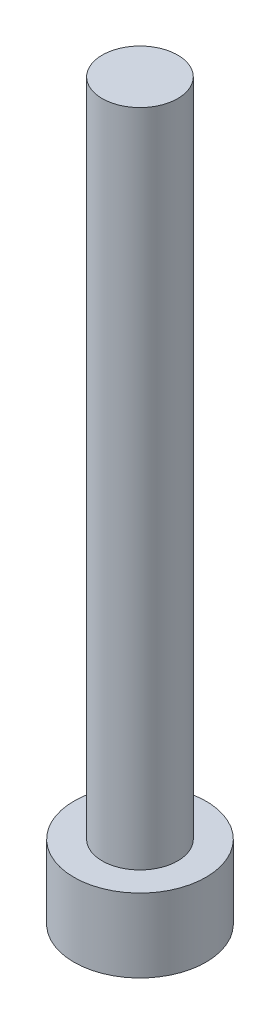
ISO-10303-21;
HEADER;
FILE_DESCRIPTION(('STEP AP214'),'2;1');
FILE_NAME('part.step','',(''),(''),'','','');
FILE_SCHEMA(('AUTOMOTIVE_DESIGN { 1 0 10303 214 1 1 1 1 }'));
ENDSEC;
DATA;
#1=APPLICATION_CONTEXT('core data for automotive mechanical design processes');
#2=APPLICATION_PROTOCOL_DEFINITION('international standard','automotive_design',2000,#1);
#3=PRODUCT_CONTEXT('',#1,'mechanical');
#4=PRODUCT('Part','Part','',(#3));
#5=PRODUCT_RELATED_PRODUCT_CATEGORY('part','',(#4));
#6=PRODUCT_DEFINITION_FORMATION('','',#4);
#7=PRODUCT_DEFINITION_CONTEXT('part definition',#1,'design');
#8=PRODUCT_DEFINITION('design','',#6,#7);
#9=PRODUCT_DEFINITION_SHAPE('','',#8);
#10=(LENGTH_UNIT() NAMED_UNIT(*) SI_UNIT(.MILLI.,.METRE.));
#11=(NAMED_UNIT(*) PLANE_ANGLE_UNIT() SI_UNIT($,.RADIAN.));
#12=(NAMED_UNIT(*) SI_UNIT($,.STERADIAN.) SOLID_ANGLE_UNIT());
#13=UNCERTAINTY_MEASURE_WITH_UNIT(LENGTH_MEASURE(1.E-05),#10,'distance_accuracy_value','');
#14=(GEOMETRIC_REPRESENTATION_CONTEXT(3) GLOBAL_UNCERTAINTY_ASSIGNED_CONTEXT((#13)) GLOBAL_UNIT_ASSIGNED_CONTEXT((#10,
#11,#12)) REPRESENTATION_CONTEXT('',''));
#15=CARTESIAN_POINT('',(0.,0.,0.));
#16=DIRECTION('',(0.,0.,1.));
#17=DIRECTION('',(1.,0.,0.));
#18=AXIS2_PLACEMENT_3D('',#15,#16,#17);
#19=CARTESIAN_POINT('',(0.,3.9,0.));
#20=DIRECTION('',(0.,-1.,0.));
#21=DIRECTION('',(0.,0.,-1.));
#22=AXIS2_PLACEMENT_3D('',#19,#20,#21);
#23=CYLINDRICAL_SURFACE('',#22,3.5);
#24=CARTESIAN_POINT('',(0.,3.9,0.));
#25=DIRECTION('',(0.,1.,0.));
#26=DIRECTION('',(0.,0.,1.));
#27=AXIS2_PLACEMENT_3D('',#24,#25,#26);
#28=CIRCLE('',#27,3.5);
#29=CARTESIAN_POINT('',(0.,3.9,3.5));
#30=VERTEX_POINT('',#29);
#31=EDGE_CURVE('E43',#30,#30,#28,.T.);
#32=ORIENTED_EDGE('',*,*,#31,.F.);
#33=EDGE_LOOP('',(#32));
#34=FACE_BOUND('',#33,.T.);
#35=CARTESIAN_POINT('',(0.,0.,0.));
#36=DIRECTION('',(0.,1.,0.));
#37=DIRECTION('',(0.,0.,1.));
#38=AXIS2_PLACEMENT_3D('',#35,#36,#37);
#39=CIRCLE('',#38,3.5);
#40=CARTESIAN_POINT('',(0.,0.,3.5));
#41=VERTEX_POINT('',#40);
#42=EDGE_CURVE('E38',#41,#41,#39,.T.);
#43=ORIENTED_EDGE('',*,*,#42,.T.);
#44=EDGE_LOOP('',(#43));
#45=FACE_BOUND('',#44,.T.);
#46=ADVANCED_FACE('F35',(#34,#45),#23,.T.);
#47=CARTESIAN_POINT('',(0.,3.9,0.));
#48=DIRECTION('',(0.,1.,0.));
#49=DIRECTION('',(0.,0.,1.));
#50=AXIS2_PLACEMENT_3D('',#47,#48,#49);
#51=PLANE('',#50);
#52=CARTESIAN_POINT('',(0.,3.9,0.));
#53=DIRECTION('',(0.,1.,0.));
#54=DIRECTION('',(0.,0.,1.));
#55=AXIS2_PLACEMENT_3D('',#52,#53,#54);
#56=CIRCLE('',#55,2.);
#57=CARTESIAN_POINT('',(0.,3.9,2.));
#58=VERTEX_POINT('',#57);
#59=EDGE_CURVE('E11',#58,#58,#56,.T.);
#60=ORIENTED_EDGE('',*,*,#59,.F.);
#61=EDGE_LOOP('',(#60));
#62=FACE_BOUND('',#61,.T.);
#63=ORIENTED_EDGE('',*,*,#31,.T.);
#64=EDGE_LOOP('',(#63));
#65=FACE_BOUND('',#64,.T.);
#66=ADVANCED_FACE('F155',(#62,#65),#51,.T.);
#67=CARTESIAN_POINT('',(0.,0.,0.));
#68=DIRECTION('',(0.,1.,0.));
#69=DIRECTION('',(0.,0.,1.));
#70=AXIS2_PLACEMENT_3D('',#67,#68,#69);
#71=PLANE('',#70);
#72=DIRECTION('',(-0.5,0.,0.866025403784438));
#73=VECTOR('',#72,1.);
#74=CARTESIAN_POINT('',(1.725,0.,0.));
#75=LINE('',#74,#73);
#76=CARTESIAN_POINT('',(1.725,0.,0.));
#77=VERTEX_POINT('',#76);
#78=CARTESIAN_POINT('',(0.862499999999999,0.,1.49389382152816));
#79=VERTEX_POINT('',#78);
#80=EDGE_CURVE('E125',#77,#79,#75,.T.);
#81=ORIENTED_EDGE('',*,*,#80,.F.);
#82=DIRECTION('',(0.5,0.,0.866025403784439));
#83=VECTOR('',#82,1.);
#84=CARTESIAN_POINT('',(0.8625,0.,-1.49389382152816));
#85=LINE('',#84,#83);
#86=CARTESIAN_POINT('',(0.8625,0.,-1.49389382152816));
#87=VERTEX_POINT('',#86);
#88=EDGE_CURVE('E51',#87,#77,#85,.T.);
#89=ORIENTED_EDGE('',*,*,#88,.F.);
#90=DIRECTION('',(1.,0.,0.));
#91=VECTOR('',#90,1.);
#92=CARTESIAN_POINT('',(-0.8625,0.,-1.49389382152816));
#93=LINE('',#92,#91);
#94=CARTESIAN_POINT('',(-0.8625,0.,-1.49389382152816));
#95=VERTEX_POINT('',#94);
#96=EDGE_CURVE('E134',#95,#87,#93,.T.);
#97=ORIENTED_EDGE('',*,*,#96,.F.);
#98=DIRECTION('',(0.5,0.,-0.866025403784439));
#99=VECTOR('',#98,1.);
#100=CARTESIAN_POINT('',(-1.725,0.,0.));
#101=LINE('',#100,#99);
#102=CARTESIAN_POINT('',(-1.725,0.,0.));
#103=VERTEX_POINT('',#102);
#104=EDGE_CURVE('E132',#103,#95,#101,.T.);
#105=ORIENTED_EDGE('',*,*,#104,.F.);
#106=DIRECTION('',(-0.5,0.,-0.866025403784439));
#107=VECTOR('',#106,1.);
#108=CARTESIAN_POINT('',(-0.8625,0.,1.49389382152816));
#109=LINE('',#108,#107);
#110=CARTESIAN_POINT('',(-0.8625,0.,1.49389382152816));
#111=VERTEX_POINT('',#110);
#112=EDGE_CURVE('E99',#111,#103,#109,.T.);
#113=ORIENTED_EDGE('',*,*,#112,.F.);
#114=DIRECTION('',(-1.,0.,0.));
#115=VECTOR('',#114,1.);
#116=CARTESIAN_POINT('',(0.862499999999999,0.,1.49389382152816));
#117=LINE('',#116,#115);
#118=EDGE_CURVE('E128',#79,#111,#117,.T.);
#119=ORIENTED_EDGE('',*,*,#118,.F.);
#120=EDGE_LOOP('',(#81,#89,#97,#105,#113,#119));
#121=FACE_BOUND('',#120,.T.);
#122=ORIENTED_EDGE('',*,*,#42,.F.);
#123=EDGE_LOOP('',(#122));
#124=FACE_BOUND('',#123,.T.);
#125=ADVANCED_FACE('F152',(#121,#124),#71,.F.);
#126=CARTESIAN_POINT('',(0.,38.9,0.));
#127=DIRECTION('',(0.,-1.,0.));
#128=DIRECTION('',(0.,0.,-1.));
#129=AXIS2_PLACEMENT_3D('',#126,#127,#128);
#130=CYLINDRICAL_SURFACE('',#129,2.);
#131=CARTESIAN_POINT('',(0.,38.9,0.));
#132=DIRECTION('',(0.,1.,0.));
#133=DIRECTION('',(0.,0.,1.));
#134=AXIS2_PLACEMENT_3D('',#131,#132,#133);
#135=CIRCLE('',#134,2.);
#136=CARTESIAN_POINT('',(0.,38.9,2.));
#137=VERTEX_POINT('',#136);
#138=EDGE_CURVE('E138',#137,#137,#135,.T.);
#139=ORIENTED_EDGE('',*,*,#138,.F.);
#140=EDGE_LOOP('',(#139));
#141=FACE_BOUND('',#140,.T.);
#142=ORIENTED_EDGE('',*,*,#59,.T.);
#143=EDGE_LOOP('',(#142));
#144=FACE_BOUND('',#143,.T.);
#145=ADVANCED_FACE('F154',(#141,#144),#130,.T.);
#146=CARTESIAN_POINT('',(0.,38.9,0.));
#147=DIRECTION('',(0.,1.,0.));
#148=DIRECTION('',(0.,0.,1.));
#149=AXIS2_PLACEMENT_3D('',#146,#147,#148);
#150=PLANE('',#149);
#151=ORIENTED_EDGE('',*,*,#138,.T.);
#152=EDGE_LOOP('',(#151));
#153=FACE_BOUND('',#152,.T.);
#154=ADVANCED_FACE('F161',(#153),#150,.T.);
#155=CARTESIAN_POINT('',(0.8625,2.4,-1.49389382152816));
#156=DIRECTION('',(0.866025403784439,0.,-0.5));
#157=DIRECTION('',(-0.5,0.,-0.866025403784439));
#158=AXIS2_PLACEMENT_3D('',#155,#156,#157);
#159=PLANE('',#158);
#160=ORIENTED_EDGE('',*,*,#88,.T.);
#161=DIRECTION('',(0.,-1.,0.));
#162=VECTOR('',#161,1.);
#163=CARTESIAN_POINT('',(1.725,2.4,0.));
#164=LINE('',#163,#162);
#165=CARTESIAN_POINT('',(1.725,2.4,0.));
#166=VERTEX_POINT('',#165);
#167=EDGE_CURVE('E81',#166,#77,#164,.T.);
#168=ORIENTED_EDGE('',*,*,#167,.F.);
#169=DIRECTION('',(0.5,0.,0.866025403784439));
#170=VECTOR('',#169,1.);
#171=CARTESIAN_POINT('',(0.8625,2.4,-1.49389382152816));
#172=LINE('',#171,#170);
#173=CARTESIAN_POINT('',(0.8625,2.4,-1.49389382152816));
#174=VERTEX_POINT('',#173);
#175=EDGE_CURVE('E136',#174,#166,#172,.T.);
#176=ORIENTED_EDGE('',*,*,#175,.F.);
#177=DIRECTION('',(0.,-1.,0.));
#178=VECTOR('',#177,1.);
#179=CARTESIAN_POINT('',(0.8625,2.4,-1.49389382152816));
#180=LINE('',#179,#178);
#181=EDGE_CURVE('E59',#174,#87,#180,.T.);
#182=ORIENTED_EDGE('',*,*,#181,.T.);
#183=EDGE_LOOP('',(#160,#168,#176,#182));
#184=FACE_BOUND('',#183,.T.);
#185=ADVANCED_FACE('F190',(#184),#159,.F.);
#186=CARTESIAN_POINT('',(-0.8625,2.4,-1.49389382152816));
#187=DIRECTION('',(0.,0.,-1.));
#188=DIRECTION('',(-1.,0.,0.));
#189=AXIS2_PLACEMENT_3D('',#186,#187,#188);
#190=PLANE('',#189);
#191=ORIENTED_EDGE('',*,*,#96,.T.);
#192=ORIENTED_EDGE('',*,*,#181,.F.);
#193=DIRECTION('',(1.,0.,0.));
#194=VECTOR('',#193,1.);
#195=CARTESIAN_POINT('',(-0.8625,2.4,-1.49389382152816));
#196=LINE('',#195,#194);
#197=CARTESIAN_POINT('',(-0.8625,2.4,-1.49389382152816));
#198=VERTEX_POINT('',#197);
#199=EDGE_CURVE('E111',#198,#174,#196,.T.);
#200=ORIENTED_EDGE('',*,*,#199,.F.);
#201=DIRECTION('',(0.,-1.,0.));
#202=VECTOR('',#201,1.);
#203=CARTESIAN_POINT('',(-0.8625,2.4,-1.49389382152816));
#204=LINE('',#203,#202);
#205=EDGE_CURVE('E103',#198,#95,#204,.T.);
#206=ORIENTED_EDGE('',*,*,#205,.T.);
#207=EDGE_LOOP('',(#191,#192,#200,#206));
#208=FACE_BOUND('',#207,.T.);
#209=ADVANCED_FACE('F204',(#208),#190,.F.);
#210=CARTESIAN_POINT('',(-1.725,2.4,0.));
#211=DIRECTION('',(-0.866025403784439,0.,-0.5));
#212=DIRECTION('',(-0.5,0.,0.866025403784439));
#213=AXIS2_PLACEMENT_3D('',#210,#211,#212);
#214=PLANE('',#213);
#215=ORIENTED_EDGE('',*,*,#104,.T.);
#216=ORIENTED_EDGE('',*,*,#205,.F.);
#217=DIRECTION('',(0.5,0.,-0.866025403784439));
#218=VECTOR('',#217,1.);
#219=CARTESIAN_POINT('',(-1.725,2.4,0.));
#220=LINE('',#219,#218);
#221=CARTESIAN_POINT('',(-1.725,2.4,0.));
#222=VERTEX_POINT('',#221);
#223=EDGE_CURVE('E107',#222,#198,#220,.T.);
#224=ORIENTED_EDGE('',*,*,#223,.F.);
#225=DIRECTION('',(0.,-1.,0.));
#226=VECTOR('',#225,1.);
#227=CARTESIAN_POINT('',(-1.725,2.4,0.));
#228=LINE('',#227,#226);
#229=EDGE_CURVE('E92',#222,#103,#228,.T.);
#230=ORIENTED_EDGE('',*,*,#229,.T.);
#231=EDGE_LOOP('',(#215,#216,#224,#230));
#232=FACE_BOUND('',#231,.T.);
#233=ADVANCED_FACE('F108',(#232),#214,.F.);
#234=CARTESIAN_POINT('',(-0.8625,2.4,1.49389382152816));
#235=DIRECTION('',(-0.866025403784439,0.,0.5));
#236=DIRECTION('',(0.5,0.,0.866025403784439));
#237=AXIS2_PLACEMENT_3D('',#234,#235,#236);
#238=PLANE('',#237);
#239=ORIENTED_EDGE('',*,*,#112,.T.);
#240=ORIENTED_EDGE('',*,*,#229,.F.);
#241=DIRECTION('',(-0.5,0.,-0.866025403784439));
#242=VECTOR('',#241,1.);
#243=CARTESIAN_POINT('',(-0.8625,2.4,1.49389382152816));
#244=LINE('',#243,#242);
#245=CARTESIAN_POINT('',(-0.8625,2.4,1.49389382152816));
#246=VERTEX_POINT('',#245);
#247=EDGE_CURVE('E96',#246,#222,#244,.T.);
#248=ORIENTED_EDGE('',*,*,#247,.F.);
#249=DIRECTION('',(0.,-1.,0.));
#250=VECTOR('',#249,1.);
#251=CARTESIAN_POINT('',(-0.8625,2.4,1.49389382152816));
#252=LINE('',#251,#250);
#253=EDGE_CURVE('E104',#246,#111,#252,.T.);
#254=ORIENTED_EDGE('',*,*,#253,.T.);
#255=EDGE_LOOP('',(#239,#240,#248,#254));
#256=FACE_BOUND('',#255,.T.);
#257=ADVANCED_FACE('F94',(#256),#238,.F.);
#258=CARTESIAN_POINT('',(0.862499999999999,2.4,1.49389382152816));
#259=DIRECTION('',(0.,0.,1.));
#260=DIRECTION('',(1.,0.,0.));
#261=AXIS2_PLACEMENT_3D('',#258,#259,#260);
#262=PLANE('',#261);
#263=ORIENTED_EDGE('',*,*,#118,.T.);
#264=ORIENTED_EDGE('',*,*,#253,.F.);
#265=DIRECTION('',(-1.,0.,0.));
#266=VECTOR('',#265,1.);
#267=CARTESIAN_POINT('',(0.862499999999999,2.4,1.49389382152816));
#268=LINE('',#267,#266);
#269=CARTESIAN_POINT('',(0.862499999999999,2.4,1.49389382152816));
#270=VERTEX_POINT('',#269);
#271=EDGE_CURVE('E117',#270,#246,#268,.T.);
#272=ORIENTED_EDGE('',*,*,#271,.F.);
#273=DIRECTION('',(0.,-1.,0.));
#274=VECTOR('',#273,1.);
#275=CARTESIAN_POINT('',(0.862499999999999,2.4,1.49389382152816));
#276=LINE('',#275,#274);
#277=EDGE_CURVE('E141',#270,#79,#276,.T.);
#278=ORIENTED_EDGE('',*,*,#277,.T.);
#279=EDGE_LOOP('',(#263,#264,#272,#278));
#280=FACE_BOUND('',#279,.T.);
#281=ADVANCED_FACE('F229',(#280),#262,.F.);
#282=CARTESIAN_POINT('',(1.725,2.4,0.));
#283=DIRECTION('',(0.866025403784439,0.,0.5));
#284=DIRECTION('',(0.5,0.,-0.866025403784439));
#285=AXIS2_PLACEMENT_3D('',#282,#283,#284);
#286=PLANE('',#285);
#287=ORIENTED_EDGE('',*,*,#80,.T.);
#288=ORIENTED_EDGE('',*,*,#277,.F.);
#289=DIRECTION('',(-0.5,0.,0.866025403784438));
#290=VECTOR('',#289,1.);
#291=CARTESIAN_POINT('',(1.725,2.4,0.));
#292=LINE('',#291,#290);
#293=EDGE_CURVE('E119',#166,#270,#292,.T.);
#294=ORIENTED_EDGE('',*,*,#293,.F.);
#295=ORIENTED_EDGE('',*,*,#167,.T.);
#296=EDGE_LOOP('',(#287,#288,#294,#295));
#297=FACE_BOUND('',#296,.T.);
#298=ADVANCED_FACE('F238',(#297),#286,.F.);
#299=CARTESIAN_POINT('',(0.,2.4,0.));
#300=DIRECTION('',(0.,-1.,0.));
#301=DIRECTION('',(0.,0.,-1.));
#302=AXIS2_PLACEMENT_3D('',#299,#300,#301);
#303=PLANE('',#302);
#304=ORIENTED_EDGE('',*,*,#175,.T.);
#305=ORIENTED_EDGE('',*,*,#293,.T.);
#306=ORIENTED_EDGE('',*,*,#271,.T.);
#307=ORIENTED_EDGE('',*,*,#247,.T.);
#308=ORIENTED_EDGE('',*,*,#223,.T.);
#309=ORIENTED_EDGE('',*,*,#199,.T.);
#310=EDGE_LOOP('',(#304,#305,#306,#307,#308,#309));
#311=FACE_BOUND('',#310,.T.);
#312=ADVANCED_FACE('F114',(#311),#303,.T.);
#313=CLOSED_SHELL('',(#46,#66,#125,#145,#154,#185,#209,#233,#257,#281,#298,#312));
#314=MANIFOLD_SOLID_BREP('B2',#313);
#315=ADVANCED_BREP_SHAPE_REPRESENTATION('',(#18,#314),#14);
#316=SHAPE_DEFINITION_REPRESENTATION(#9,#315);
ENDSEC;
END-ISO-10303-21;
